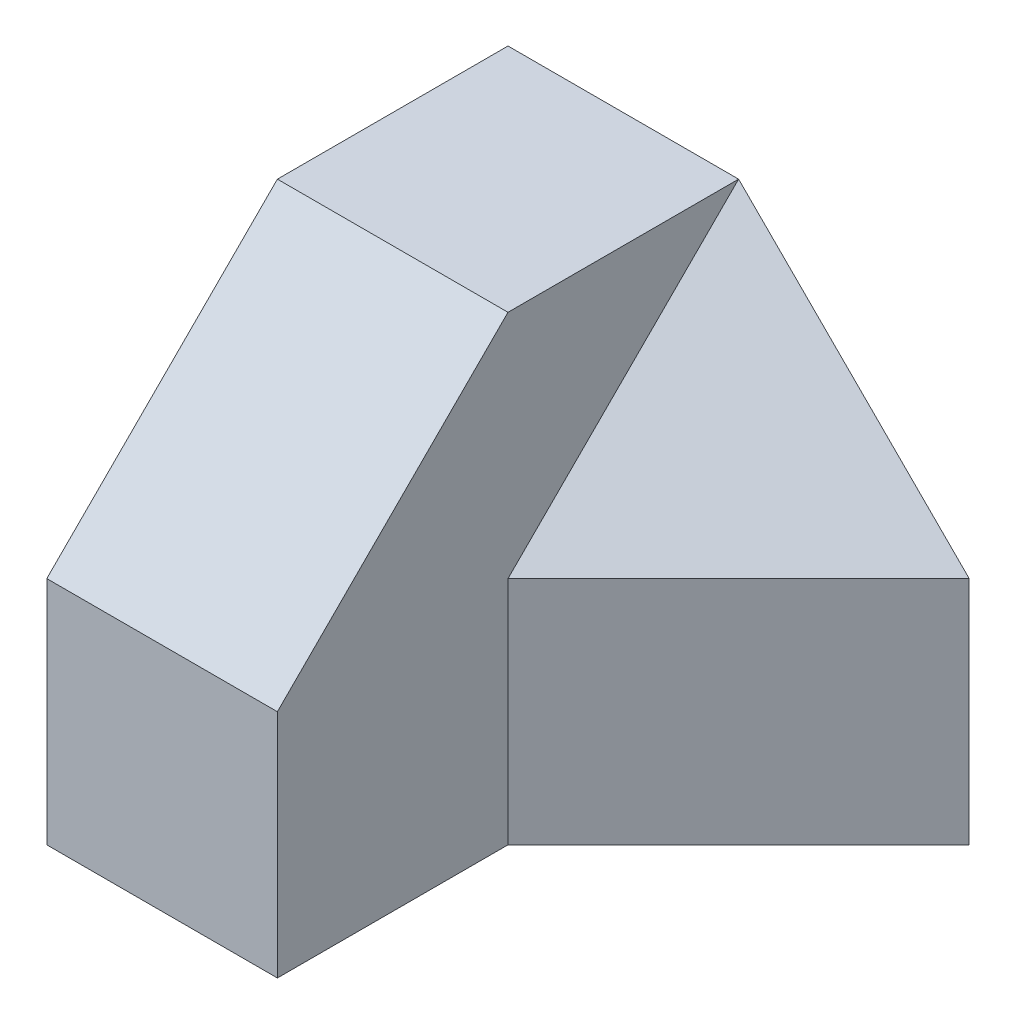
ISO-10303-21;
HEADER;
FILE_DESCRIPTION(('STEP AP214'),'2;1');
FILE_NAME('part.step','',(''),(''),'','','');
FILE_SCHEMA(('AUTOMOTIVE_DESIGN { 1 0 10303 214 1 1 1 1 }'));
ENDSEC;
DATA;
#1=APPLICATION_CONTEXT('core data for automotive mechanical design processes');
#2=APPLICATION_PROTOCOL_DEFINITION('international standard','automotive_design',2000,#1);
#3=PRODUCT_CONTEXT('',#1,'mechanical');
#4=PRODUCT('Part','Part','',(#3));
#5=PRODUCT_RELATED_PRODUCT_CATEGORY('part','',(#4));
#6=PRODUCT_DEFINITION_FORMATION('','',#4);
#7=PRODUCT_DEFINITION_CONTEXT('part definition',#1,'design');
#8=PRODUCT_DEFINITION('design','',#6,#7);
#9=PRODUCT_DEFINITION_SHAPE('','',#8);
#10=(LENGTH_UNIT() NAMED_UNIT(*) SI_UNIT(.MILLI.,.METRE.));
#11=(NAMED_UNIT(*) PLANE_ANGLE_UNIT() SI_UNIT($,.RADIAN.));
#12=(NAMED_UNIT(*) SI_UNIT($,.STERADIAN.) SOLID_ANGLE_UNIT());
#13=UNCERTAINTY_MEASURE_WITH_UNIT(LENGTH_MEASURE(1.E-05),#10,'distance_accuracy_value','');
#14=(GEOMETRIC_REPRESENTATION_CONTEXT(3) GLOBAL_UNCERTAINTY_ASSIGNED_CONTEXT((#13)) GLOBAL_UNIT_ASSIGNED_CONTEXT((#10,
#11,#12)) REPRESENTATION_CONTEXT('',''));
#15=CARTESIAN_POINT('',(0.,0.,0.));
#16=DIRECTION('',(0.,0.,1.));
#17=DIRECTION('',(1.,0.,0.));
#18=AXIS2_PLACEMENT_3D('',#15,#16,#17);
#19=CARTESIAN_POINT('',(2.,-2.,0.));
#20=DIRECTION('',(-0.707106781186547,0.,-0.707106781186547));
#21=DIRECTION('',(-0.707106781186548,0.,0.707106781186548));
#22=AXIS2_PLACEMENT_3D('',#19,#20,#21);
#23=PLANE('',#22);
#24=DIRECTION('',(0.707106781186548,0.,-0.707106781186548));
#25=VECTOR('',#24,1.);
#26=CARTESIAN_POINT('',(2.,0.,0.));
#27=LINE('',#26,#25);
#28=CARTESIAN_POINT('',(2.,0.,0.));
#29=VERTEX_POINT('',#28);
#30=CARTESIAN_POINT('',(4.,0.,-2.));
#31=VERTEX_POINT('',#30);
#32=EDGE_CURVE('E98',#29,#31,#27,.T.);
#33=ORIENTED_EDGE('',*,*,#32,.F.);
#34=DIRECTION('',(0.,1.,0.));
#35=VECTOR('',#34,1.);
#36=CARTESIAN_POINT('',(2.,-2.,0.));
#37=LINE('',#36,#35);
#38=CARTESIAN_POINT('',(2.,-2.,0.));
#39=VERTEX_POINT('',#38);
#40=EDGE_CURVE('E108',#39,#29,#37,.T.);
#41=ORIENTED_EDGE('',*,*,#40,.F.);
#42=DIRECTION('',(-0.707106781186548,0.,0.707106781186548));
#43=VECTOR('',#42,1.);
#44=CARTESIAN_POINT('',(2.,-2.,0.));
#45=LINE('',#44,#43);
#46=CARTESIAN_POINT('',(4.,-2.,-2.));
#47=VERTEX_POINT('',#46);
#48=EDGE_CURVE('E105',#47,#39,#45,.T.);
#49=ORIENTED_EDGE('',*,*,#48,.F.);
#50=DIRECTION('',(0.,1.,0.));
#51=VECTOR('',#50,1.);
#52=CARTESIAN_POINT('',(4.,-2.,-2.));
#53=LINE('',#52,#51);
#54=EDGE_CURVE('E111',#47,#31,#53,.T.);
#55=ORIENTED_EDGE('',*,*,#54,.T.);
#56=EDGE_LOOP('',(#33,#41,#49,#55));
#57=FACE_BOUND('',#56,.T.);
#58=ADVANCED_FACE('F38',(#57),#23,.F.);
#59=CARTESIAN_POINT('',(4.,-2.,-2.));
#60=DIRECTION('',(0.,0.,1.));
#61=DIRECTION('',(1.,0.,0.));
#62=AXIS2_PLACEMENT_3D('',#59,#60,#61);
#63=PLANE('',#62);
#64=DIRECTION('',(-1.,0.,0.));
#65=VECTOR('',#64,1.);
#66=CARTESIAN_POINT('',(4.,2.,-2.));
#67=LINE('',#66,#65);
#68=CARTESIAN_POINT('',(2.,2.,-2.));
#69=VERTEX_POINT('',#68);
#70=CARTESIAN_POINT('',(0.,2.,-2.));
#71=VERTEX_POINT('',#70);
#72=EDGE_CURVE('E144',#69,#71,#67,.T.);
#73=ORIENTED_EDGE('',*,*,#72,.F.);
#74=DIRECTION('',(0.707106781186548,-0.707106781186548,0.));
#75=VECTOR('',#74,1.);
#76=CARTESIAN_POINT('',(2.,2.,-2.));
#77=LINE('',#76,#75);
#78=EDGE_CURVE('E101',#69,#31,#77,.T.);
#79=ORIENTED_EDGE('',*,*,#78,.T.);
#80=ORIENTED_EDGE('',*,*,#54,.F.);
#81=DIRECTION('',(-1.,0.,0.));
#82=VECTOR('',#81,1.);
#83=CARTESIAN_POINT('',(4.,-2.,-2.));
#84=LINE('',#83,#82);
#85=CARTESIAN_POINT('',(0.,-2.,-2.));
#86=VERTEX_POINT('',#85);
#87=EDGE_CURVE('E138',#47,#86,#84,.T.);
#88=ORIENTED_EDGE('',*,*,#87,.T.);
#89=DIRECTION('',(0.,1.,0.));
#90=VECTOR('',#89,1.);
#91=CARTESIAN_POINT('',(0.,-2.,-2.));
#92=LINE('',#91,#90);
#93=EDGE_CURVE('E128',#86,#71,#92,.T.);
#94=ORIENTED_EDGE('',*,*,#93,.T.);
#95=EDGE_LOOP('',(#73,#79,#80,#88,#94));
#96=FACE_BOUND('',#95,.T.);
#97=ADVANCED_FACE('F162',(#96),#63,.F.);
#98=CARTESIAN_POINT('',(4.,2.,2.));
#99=DIRECTION('',(0.,-1.,0.));
#100=DIRECTION('',(0.,0.,-1.));
#101=AXIS2_PLACEMENT_3D('',#98,#99,#100);
#102=PLANE('',#101);
#103=DIRECTION('',(0.,0.,1.));
#104=VECTOR('',#103,1.);
#105=CARTESIAN_POINT('',(0.,2.,2.));
#106=LINE('',#105,#104);
#107=CARTESIAN_POINT('',(0.,2.,0.));
#108=VERTEX_POINT('',#107);
#109=EDGE_CURVE('E131',#71,#108,#106,.T.);
#110=ORIENTED_EDGE('',*,*,#109,.T.);
#111=DIRECTION('',(1.,0.,0.));
#112=VECTOR('',#111,1.);
#113=CARTESIAN_POINT('',(4.,2.,0.));
#114=LINE('',#113,#112);
#115=CARTESIAN_POINT('',(2.,2.,0.));
#116=VERTEX_POINT('',#115);
#117=EDGE_CURVE('E47',#108,#116,#114,.T.);
#118=ORIENTED_EDGE('',*,*,#117,.T.);
#119=DIRECTION('',(0.,0.,1.));
#120=VECTOR('',#119,1.);
#121=CARTESIAN_POINT('',(2.,2.,-2.));
#122=LINE('',#121,#120);
#123=EDGE_CURVE('E132',#69,#116,#122,.T.);
#124=ORIENTED_EDGE('',*,*,#123,.F.);
#125=ORIENTED_EDGE('',*,*,#72,.T.);
#126=EDGE_LOOP('',(#110,#118,#124,#125));
#127=FACE_BOUND('',#126,.T.);
#128=ADVANCED_FACE('F150',(#127),#102,.F.);
#129=CARTESIAN_POINT('',(4.,-2.,2.));
#130=DIRECTION('',(0.,0.,-1.));
#131=DIRECTION('',(-1.,0.,0.));
#132=AXIS2_PLACEMENT_3D('',#129,#130,#131);
#133=PLANE('',#132);
#134=DIRECTION('',(0.,1.,0.));
#135=VECTOR('',#134,1.);
#136=CARTESIAN_POINT('',(2.,-2.,2.));
#137=LINE('',#136,#135);
#138=CARTESIAN_POINT('',(2.,-2.,2.));
#139=VERTEX_POINT('',#138);
#140=CARTESIAN_POINT('',(2.,0.,2.));
#141=VERTEX_POINT('',#140);
#142=EDGE_CURVE('E117',#139,#141,#137,.T.);
#143=ORIENTED_EDGE('',*,*,#142,.T.);
#144=DIRECTION('',(-1.,0.,0.));
#145=VECTOR('',#144,1.);
#146=CARTESIAN_POINT('',(4.,0.,2.));
#147=LINE('',#146,#145);
#148=CARTESIAN_POINT('',(0.,0.,2.));
#149=VERTEX_POINT('',#148);
#150=EDGE_CURVE('E145',#141,#149,#147,.T.);
#151=ORIENTED_EDGE('',*,*,#150,.T.);
#152=DIRECTION('',(0.,-1.,0.));
#153=VECTOR('',#152,1.);
#154=CARTESIAN_POINT('',(0.,-2.,2.));
#155=LINE('',#154,#153);
#156=CARTESIAN_POINT('',(0.,-2.,2.));
#157=VERTEX_POINT('',#156);
#158=EDGE_CURVE('E134',#149,#157,#155,.T.);
#159=ORIENTED_EDGE('',*,*,#158,.T.);
#160=DIRECTION('',(-1.,0.,0.));
#161=VECTOR('',#160,1.);
#162=CARTESIAN_POINT('',(4.,-2.,2.));
#163=LINE('',#162,#161);
#164=EDGE_CURVE('E141',#139,#157,#163,.T.);
#165=ORIENTED_EDGE('',*,*,#164,.F.);
#166=EDGE_LOOP('',(#143,#151,#159,#165));
#167=FACE_BOUND('',#166,.T.);
#168=ADVANCED_FACE('F154',(#167),#133,.F.);
#169=CARTESIAN_POINT('',(4.,-2.,2.));
#170=DIRECTION('',(0.,1.,0.));
#171=DIRECTION('',(0.,0.,1.));
#172=AXIS2_PLACEMENT_3D('',#169,#170,#171);
#173=PLANE('',#172);
#174=ORIENTED_EDGE('',*,*,#48,.T.);
#175=DIRECTION('',(0.,0.,1.));
#176=VECTOR('',#175,1.);
#177=CARTESIAN_POINT('',(2.,-2.,0.));
#178=LINE('',#177,#176);
#179=EDGE_CURVE('E115',#39,#139,#178,.T.);
#180=ORIENTED_EDGE('',*,*,#179,.T.);
#181=ORIENTED_EDGE('',*,*,#164,.T.);
#182=DIRECTION('',(0.,0.,-1.));
#183=VECTOR('',#182,1.);
#184=CARTESIAN_POINT('',(0.,-2.,2.));
#185=LINE('',#184,#183);
#186=EDGE_CURVE('E136',#157,#86,#185,.T.);
#187=ORIENTED_EDGE('',*,*,#186,.T.);
#188=ORIENTED_EDGE('',*,*,#87,.F.);
#189=EDGE_LOOP('',(#174,#180,#181,#187,#188));
#190=FACE_BOUND('',#189,.T.);
#191=ADVANCED_FACE('F157',(#190),#173,.F.);
#192=CARTESIAN_POINT('',(0.,0.,0.));
#193=DIRECTION('',(-1.,0.,0.));
#194=DIRECTION('',(0.,0.,1.));
#195=AXIS2_PLACEMENT_3D('',#192,#193,#194);
#196=PLANE('',#195);
#197=ORIENTED_EDGE('',*,*,#158,.F.);
#198=DIRECTION('',(0.,-0.707106781186548,0.707106781186548));
#199=VECTOR('',#198,1.);
#200=CARTESIAN_POINT('',(0.,1.,1.));
#201=LINE('',#200,#199);
#202=EDGE_CURVE('E55',#149,#108,#201,.F.);
#203=ORIENTED_EDGE('',*,*,#202,.T.);
#204=ORIENTED_EDGE('',*,*,#109,.F.);
#205=ORIENTED_EDGE('',*,*,#93,.F.);
#206=ORIENTED_EDGE('',*,*,#186,.F.);
#207=EDGE_LOOP('',(#197,#203,#204,#205,#206));
#208=FACE_BOUND('',#207,.T.);
#209=ADVANCED_FACE('F160',(#208),#196,.T.);
#210=CARTESIAN_POINT('',(2.,-2.,0.));
#211=DIRECTION('',(-1.,0.,0.));
#212=DIRECTION('',(0.,0.,1.));
#213=AXIS2_PLACEMENT_3D('',#210,#211,#212);
#214=PLANE('',#213);
#215=ORIENTED_EDGE('',*,*,#40,.T.);
#216=DIRECTION('',(0.,-0.707106781186548,0.707106781186548));
#217=VECTOR('',#216,1.);
#218=CARTESIAN_POINT('',(2.,2.,-2.));
#219=LINE('',#218,#217);
#220=EDGE_CURVE('E95',#69,#29,#219,.T.);
#221=ORIENTED_EDGE('',*,*,#220,.F.);
#222=ORIENTED_EDGE('',*,*,#123,.T.);
#223=DIRECTION('',(0.,0.707106781186548,-0.707106781186548));
#224=VECTOR('',#223,1.);
#225=CARTESIAN_POINT('',(2.,0.,2.));
#226=LINE('',#225,#224);
#227=EDGE_CURVE('E14',#116,#141,#226,.F.);
#228=ORIENTED_EDGE('',*,*,#227,.T.);
#229=ORIENTED_EDGE('',*,*,#142,.F.);
#230=ORIENTED_EDGE('',*,*,#179,.F.);
#231=EDGE_LOOP('',(#215,#221,#222,#228,#229,#230));
#232=FACE_BOUND('',#231,.T.);
#233=ADVANCED_FACE('F113',(#232),#214,.F.);
#234=CARTESIAN_POINT('',(4.,0.,2.));
#235=DIRECTION('',(0.,-0.707106781186548,-0.707106781186548));
#236=DIRECTION('',(-1.,0.,0.));
#237=AXIS2_PLACEMENT_3D('',#234,#235,#236);
#238=PLANE('',#237);
#239=ORIENTED_EDGE('',*,*,#227,.F.);
#240=ORIENTED_EDGE('',*,*,#117,.F.);
#241=ORIENTED_EDGE('',*,*,#202,.F.);
#242=ORIENTED_EDGE('',*,*,#150,.F.);
#243=EDGE_LOOP('',(#239,#240,#241,#242));
#244=FACE_BOUND('',#243,.T.);
#245=ADVANCED_FACE('F40',(#244),#238,.F.);
#246=CARTESIAN_POINT('',(0.666666666666671,0.666666666666668,0.666666666666669));
#247=DIRECTION('',(0.577350269189627,0.577350269189625,0.577350269189625));
#248=DIRECTION('',(0.707106781186546,0.,-0.707106781186549));
#249=AXIS2_PLACEMENT_3D('',#246,#247,#248);
#250=PLANE('',#249);
#251=ORIENTED_EDGE('',*,*,#78,.F.);
#252=ORIENTED_EDGE('',*,*,#220,.T.);
#253=ORIENTED_EDGE('',*,*,#32,.T.);
#254=EDGE_LOOP('',(#251,#252,#253));
#255=FACE_BOUND('',#254,.T.);
#256=ADVANCED_FACE('F97',(#255),#250,.T.);
#257=CLOSED_SHELL('',(#58,#97,#128,#168,#191,#209,#233,#245,#256));
#258=MANIFOLD_SOLID_BREP('B2',#257);
#259=ADVANCED_BREP_SHAPE_REPRESENTATION('',(#18,#258),#14);
#260=SHAPE_DEFINITION_REPRESENTATION(#9,#259);
ENDSEC;
END-ISO-10303-21;
